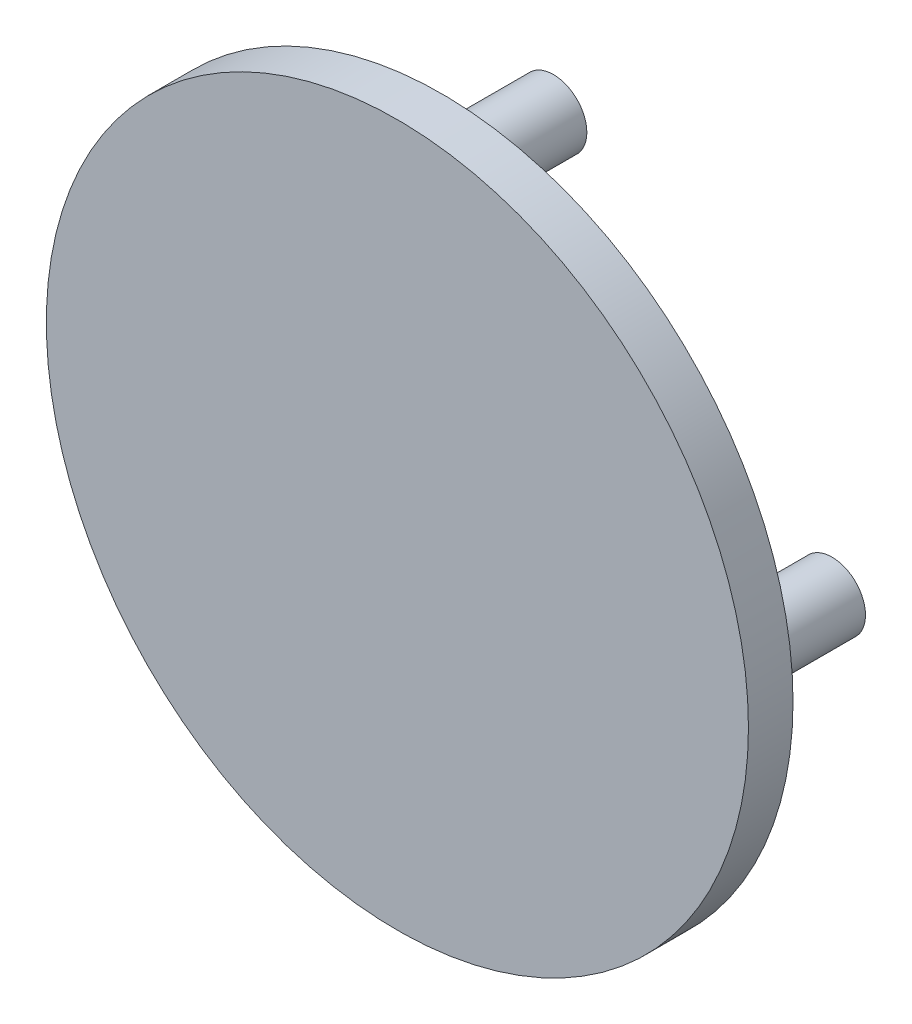
ISO-10303-21;
HEADER;
FILE_DESCRIPTION(('STEP AP214'),'2;1');
FILE_NAME('part.step','',(''),(''),'','','');
FILE_SCHEMA(('AUTOMOTIVE_DESIGN { 1 0 10303 214 1 1 1 1 }'));
ENDSEC;
DATA;
#1=APPLICATION_CONTEXT('core data for automotive mechanical design processes');
#2=APPLICATION_PROTOCOL_DEFINITION('international standard','automotive_design',2000,#1);
#3=PRODUCT_CONTEXT('',#1,'mechanical');
#4=PRODUCT('Part','Part','',(#3));
#5=PRODUCT_RELATED_PRODUCT_CATEGORY('part','',(#4));
#6=PRODUCT_DEFINITION_FORMATION('','',#4);
#7=PRODUCT_DEFINITION_CONTEXT('part definition',#1,'design');
#8=PRODUCT_DEFINITION('design','',#6,#7);
#9=PRODUCT_DEFINITION_SHAPE('','',#8);
#10=(LENGTH_UNIT() NAMED_UNIT(*) SI_UNIT(.MILLI.,.METRE.));
#11=(NAMED_UNIT(*) PLANE_ANGLE_UNIT() SI_UNIT($,.RADIAN.));
#12=(NAMED_UNIT(*) SI_UNIT($,.STERADIAN.) SOLID_ANGLE_UNIT());
#13=UNCERTAINTY_MEASURE_WITH_UNIT(LENGTH_MEASURE(1.E-05),#10,'distance_accuracy_value','');
#14=(GEOMETRIC_REPRESENTATION_CONTEXT(3) GLOBAL_UNCERTAINTY_ASSIGNED_CONTEXT((#13)) GLOBAL_UNIT_ASSIGNED_CONTEXT((#10,
#11,#12)) REPRESENTATION_CONTEXT('',''));
#15=CARTESIAN_POINT('',(0.,0.,0.));
#16=DIRECTION('',(0.,0.,1.));
#17=DIRECTION('',(1.,0.,0.));
#18=AXIS2_PLACEMENT_3D('',#15,#16,#17);
#19=CARTESIAN_POINT('',(0.,0.,8.));
#20=DIRECTION('',(0.,0.,-1.));
#21=DIRECTION('',(-1.,0.,0.));
#22=AXIS2_PLACEMENT_3D('',#19,#20,#21);
#23=CYLINDRICAL_SURFACE('',#22,25.);
#24=CARTESIAN_POINT('',(0.,0.,8.));
#25=DIRECTION('',(0.,0.,1.));
#26=DIRECTION('',(1.,0.,0.));
#27=AXIS2_PLACEMENT_3D('',#24,#25,#26);
#28=CIRCLE('',#27,25.);
#29=CARTESIAN_POINT('',(25.,0.,8.));
#30=VERTEX_POINT('',#29);
#31=EDGE_CURVE('E50',#30,#30,#28,.T.);
#32=ORIENTED_EDGE('',*,*,#31,.F.);
#33=EDGE_LOOP('',(#32));
#34=FACE_BOUND('',#33,.T.);
#35=CARTESIAN_POINT('',(0.,0.,0.));
#36=DIRECTION('',(0.,0.,1.));
#37=DIRECTION('',(1.,0.,0.));
#38=AXIS2_PLACEMENT_3D('',#35,#36,#37);
#39=CIRCLE('',#38,25.);
#40=CARTESIAN_POINT('',(25.,0.,0.));
#41=VERTEX_POINT('',#40);
#42=EDGE_CURVE('E51',#41,#41,#39,.T.);
#43=ORIENTED_EDGE('',*,*,#42,.T.);
#44=EDGE_LOOP('',(#43));
#45=FACE_BOUND('',#44,.T.);
#46=ADVANCED_FACE('F31',(#34,#45),#23,.T.);
#47=CARTESIAN_POINT('',(0.,0.,0.));
#48=DIRECTION('',(0.,0.,1.));
#49=DIRECTION('',(1.,0.,0.));
#50=AXIS2_PLACEMENT_3D('',#47,#48,#49);
#51=PLANE('',#50);
#52=ORIENTED_EDGE('',*,*,#42,.F.);
#53=EDGE_LOOP('',(#52));
#54=FACE_BOUND('',#53,.T.);
#55=ADVANCED_FACE('F90',(#54),#51,.F.);
#56=CARTESIAN_POINT('',(0.,0.,16.));
#57=DIRECTION('',(0.,0.,-1.));
#58=DIRECTION('',(-1.,0.,0.));
#59=AXIS2_PLACEMENT_3D('',#56,#57,#58);
#60=CYLINDRICAL_SURFACE('',#59,63.);
#61=CARTESIAN_POINT('',(0.,0.,16.));
#62=DIRECTION('',(0.,0.,1.));
#63=DIRECTION('',(1.,0.,0.));
#64=AXIS2_PLACEMENT_3D('',#61,#62,#63);
#65=CIRCLE('',#64,63.);
#66=CARTESIAN_POINT('',(63.,0.,16.));
#67=VERTEX_POINT('',#66);
#68=EDGE_CURVE('E54',#67,#67,#65,.T.);
#69=ORIENTED_EDGE('',*,*,#68,.F.);
#70=EDGE_LOOP('',(#69));
#71=FACE_BOUND('',#70,.T.);
#72=CARTESIAN_POINT('',(0.,0.,8.));
#73=DIRECTION('',(0.,0.,1.));
#74=DIRECTION('',(1.,0.,0.));
#75=AXIS2_PLACEMENT_3D('',#72,#73,#74);
#76=CIRCLE('',#75,63.);
#77=CARTESIAN_POINT('',(63.,0.,8.));
#78=VERTEX_POINT('',#77);
#79=EDGE_CURVE('E57',#78,#78,#76,.T.);
#80=ORIENTED_EDGE('',*,*,#79,.T.);
#81=EDGE_LOOP('',(#80));
#82=FACE_BOUND('',#81,.T.);
#83=ADVANCED_FACE('F95',(#71,#82),#60,.T.);
#84=CARTESIAN_POINT('',(0.,0.,16.));
#85=DIRECTION('',(0.,0.,1.));
#86=DIRECTION('',(1.,0.,0.));
#87=AXIS2_PLACEMENT_3D('',#84,#85,#86);
#88=PLANE('',#87);
#89=ORIENTED_EDGE('',*,*,#68,.T.);
#90=EDGE_LOOP('',(#89));
#91=FACE_BOUND('',#90,.T.);
#92=ADVANCED_FACE('F105',(#91),#88,.T.);
#93=CARTESIAN_POINT('',(0.,0.,8.));
#94=DIRECTION('',(0.,0.,1.));
#95=DIRECTION('',(1.,0.,0.));
#96=AXIS2_PLACEMENT_3D('',#93,#94,#95);
#97=PLANE('',#96);
#98=CARTESIAN_POINT('',(49.9999999999986,-1.4210854715202E-12,8.));
#99=DIRECTION('',(0.,0.,1.));
#100=DIRECTION('',(1.,0.,0.));
#101=AXIS2_PLACEMENT_3D('',#98,#99,#100);
#102=CIRCLE('',#101,6.00000000000227);
#103=CARTESIAN_POINT('',(56.0000000000009,-1.4210854715202E-12,8.));
#104=VERTEX_POINT('',#103);
#105=EDGE_CURVE('E10',#104,#104,#102,.F.);
#106=ORIENTED_EDGE('',*,*,#105,.F.);
#107=EDGE_LOOP('',(#106));
#108=FACE_BOUND('',#107,.T.);
#109=CARTESIAN_POINT('',(-2.82992447504893E-12,-50.,8.));
#110=DIRECTION('',(0.,0.,1.));
#111=DIRECTION('',(1.,0.,0.));
#112=AXIS2_PLACEMENT_3D('',#109,#110,#111);
#113=CIRCLE('',#112,6.00000000000304);
#114=CARTESIAN_POINT('',(6.00000000000021,-50.,8.));
#115=VERTEX_POINT('',#114);
#116=EDGE_CURVE('E37',#115,#115,#113,.F.);
#117=ORIENTED_EDGE('',*,*,#116,.F.);
#118=EDGE_LOOP('',(#117));
#119=FACE_BOUND('',#118,.T.);
#120=CARTESIAN_POINT('',(-50.0000000000014,1.41496223752446E-12,8.));
#121=DIRECTION('',(0.,0.,1.));
#122=DIRECTION('',(1.,0.,0.));
#123=AXIS2_PLACEMENT_3D('',#120,#121,#122);
#124=CIRCLE('',#123,6.0000000000011);
#125=CARTESIAN_POINT('',(-44.0000000000003,1.41496223752446E-12,8.));
#126=VERTEX_POINT('',#125);
#127=EDGE_CURVE('E41',#126,#126,#124,.F.);
#128=ORIENTED_EDGE('',*,*,#127,.F.);
#129=EDGE_LOOP('',(#128));
#130=FACE_BOUND('',#129,.T.);
#131=CARTESIAN_POINT('',(0.,50.,8.));
#132=DIRECTION('',(0.,0.,1.));
#133=DIRECTION('',(1.,0.,0.));
#134=AXIS2_PLACEMENT_3D('',#131,#132,#133);
#135=CIRCLE('',#134,6.);
#136=CARTESIAN_POINT('',(6.,50.,8.));
#137=VERTEX_POINT('',#136);
#138=EDGE_CURVE('E45',#137,#137,#135,.F.);
#139=ORIENTED_EDGE('',*,*,#138,.F.);
#140=EDGE_LOOP('',(#139));
#141=FACE_BOUND('',#140,.T.);
#142=ORIENTED_EDGE('',*,*,#31,.T.);
#143=EDGE_LOOP('',(#142));
#144=FACE_BOUND('',#143,.T.);
#145=ORIENTED_EDGE('',*,*,#79,.F.);
#146=EDGE_LOOP('',(#145));
#147=FACE_BOUND('',#146,.T.);
#148=ADVANCED_FACE('F101',(#108,#119,#130,#141,#144,#147),#97,.F.);
#149=CARTESIAN_POINT('',(0.,50.,-12.));
#150=DIRECTION('',(0.,0.,1.));
#151=DIRECTION('',(1.,0.,0.));
#152=AXIS2_PLACEMENT_3D('',#149,#150,#151);
#153=CYLINDRICAL_SURFACE('',#152,6.);
#154=CARTESIAN_POINT('',(0.,50.,-12.));
#155=DIRECTION('',(0.,0.,-1.));
#156=DIRECTION('',(-1.,0.,0.));
#157=AXIS2_PLACEMENT_3D('',#154,#155,#156);
#158=CIRCLE('',#157,6.);
#159=CARTESIAN_POINT('',(-6.,50.,-12.));
#160=VERTEX_POINT('',#159);
#161=EDGE_CURVE('E60',#160,#160,#158,.T.);
#162=ORIENTED_EDGE('',*,*,#161,.F.);
#163=EDGE_LOOP('',(#162));
#164=FACE_BOUND('',#163,.T.);
#165=ORIENTED_EDGE('',*,*,#138,.T.);
#166=EDGE_LOOP('',(#165));
#167=FACE_BOUND('',#166,.T.);
#168=ADVANCED_FACE('F104',(#164,#167),#153,.T.);
#169=CARTESIAN_POINT('',(0.,50.,-12.));
#170=DIRECTION('',(0.,0.,-1.));
#171=DIRECTION('',(-1.,0.,0.));
#172=AXIS2_PLACEMENT_3D('',#169,#170,#171);
#173=PLANE('',#172);
#174=ORIENTED_EDGE('',*,*,#161,.T.);
#175=EDGE_LOOP('',(#174));
#176=FACE_BOUND('',#175,.T.);
#177=ADVANCED_FACE('F122',(#176),#173,.T.);
#178=CARTESIAN_POINT('',(-50.0000000000014,1.41496223752446E-12,-12.));
#179=DIRECTION('',(0.,0.,1.));
#180=DIRECTION('',(1.,0.,0.));
#181=AXIS2_PLACEMENT_3D('',#178,#179,#180);
#182=CYLINDRICAL_SURFACE('',#181,6.0000000000011);
#183=CARTESIAN_POINT('',(-50.0000000000014,1.41496223752446E-12,-12.));
#184=DIRECTION('',(0.,0.,-1.));
#185=DIRECTION('',(-1.,0.,0.));
#186=AXIS2_PLACEMENT_3D('',#183,#184,#185);
#187=CIRCLE('',#186,6.0000000000011);
#188=CARTESIAN_POINT('',(-56.0000000000025,1.41496223752446E-12,-12.));
#189=VERTEX_POINT('',#188);
#190=EDGE_CURVE('E65',#189,#189,#187,.T.);
#191=ORIENTED_EDGE('',*,*,#190,.F.);
#192=EDGE_LOOP('',(#191));
#193=FACE_BOUND('',#192,.T.);
#194=ORIENTED_EDGE('',*,*,#127,.T.);
#195=EDGE_LOOP('',(#194));
#196=FACE_BOUND('',#195,.T.);
#197=ADVANCED_FACE('F126',(#193,#196),#182,.T.);
#198=CARTESIAN_POINT('',(-50.0000000000014,1.41496223752446E-12,-12.));
#199=DIRECTION('',(0.,0.,-1.));
#200=DIRECTION('',(-1.,0.,0.));
#201=AXIS2_PLACEMENT_3D('',#198,#199,#200);
#202=PLANE('',#201);
#203=ORIENTED_EDGE('',*,*,#190,.T.);
#204=EDGE_LOOP('',(#203));
#205=FACE_BOUND('',#204,.T.);
#206=ADVANCED_FACE('F130',(#205),#202,.T.);
#207=CARTESIAN_POINT('',(-2.82992447504893E-12,-50.,-12.));
#208=DIRECTION('',(0.,0.,1.));
#209=DIRECTION('',(1.,0.,0.));
#210=AXIS2_PLACEMENT_3D('',#207,#208,#209);
#211=CYLINDRICAL_SURFACE('',#210,6.00000000000304);
#212=CARTESIAN_POINT('',(-2.82992447504893E-12,-50.,-12.));
#213=DIRECTION('',(0.,0.,-1.));
#214=DIRECTION('',(-1.,0.,0.));
#215=AXIS2_PLACEMENT_3D('',#212,#213,#214);
#216=CIRCLE('',#215,6.00000000000304);
#217=CARTESIAN_POINT('',(-6.00000000000587,-50.,-12.));
#218=VERTEX_POINT('',#217);
#219=EDGE_CURVE('E68',#218,#218,#216,.T.);
#220=ORIENTED_EDGE('',*,*,#219,.F.);
#221=EDGE_LOOP('',(#220));
#222=FACE_BOUND('',#221,.T.);
#223=ORIENTED_EDGE('',*,*,#116,.T.);
#224=EDGE_LOOP('',(#223));
#225=FACE_BOUND('',#224,.T.);
#226=ADVANCED_FACE('F86',(#222,#225),#211,.T.);
#227=CARTESIAN_POINT('',(-2.82992447504893E-12,-50.,-12.));
#228=DIRECTION('',(0.,0.,-1.));
#229=DIRECTION('',(-1.,0.,0.));
#230=AXIS2_PLACEMENT_3D('',#227,#228,#229);
#231=PLANE('',#230);
#232=ORIENTED_EDGE('',*,*,#219,.T.);
#233=EDGE_LOOP('',(#232));
#234=FACE_BOUND('',#233,.T.);
#235=ADVANCED_FACE('F79',(#234),#231,.T.);
#236=CARTESIAN_POINT('',(49.9999999999986,-1.4210854715202E-12,-12.));
#237=DIRECTION('',(0.,0.,1.));
#238=DIRECTION('',(1.,0.,0.));
#239=AXIS2_PLACEMENT_3D('',#236,#237,#238);
#240=CYLINDRICAL_SURFACE('',#239,6.00000000000227);
#241=CARTESIAN_POINT('',(49.9999999999986,-1.4210854715202E-12,-12.));
#242=DIRECTION('',(0.,0.,-1.));
#243=DIRECTION('',(-1.,0.,0.));
#244=AXIS2_PLACEMENT_3D('',#241,#242,#243);
#245=CIRCLE('',#244,6.00000000000227);
#246=CARTESIAN_POINT('',(43.9999999999963,-1.4210854715202E-12,-12.));
#247=VERTEX_POINT('',#246);
#248=EDGE_CURVE('E71',#247,#247,#245,.T.);
#249=ORIENTED_EDGE('',*,*,#248,.F.);
#250=EDGE_LOOP('',(#249));
#251=FACE_BOUND('',#250,.T.);
#252=ORIENTED_EDGE('',*,*,#105,.T.);
#253=EDGE_LOOP('',(#252));
#254=FACE_BOUND('',#253,.T.);
#255=ADVANCED_FACE('F77',(#251,#254),#240,.T.);
#256=CARTESIAN_POINT('',(49.9999999999986,-1.4210854715202E-12,-12.));
#257=DIRECTION('',(0.,0.,-1.));
#258=DIRECTION('',(-1.,0.,0.));
#259=AXIS2_PLACEMENT_3D('',#256,#257,#258);
#260=PLANE('',#259);
#261=ORIENTED_EDGE('',*,*,#248,.T.);
#262=EDGE_LOOP('',(#261));
#263=FACE_BOUND('',#262,.T.);
#264=ADVANCED_FACE('F75',(#263),#260,.T.);
#265=CLOSED_SHELL('',(#46,#55,#83,#92,#148,#168,#177,#197,#206,#226,#235,#255,#264));
#266=MANIFOLD_SOLID_BREP('B2',#265);
#267=ADVANCED_BREP_SHAPE_REPRESENTATION('',(#18,#266),#14);
#268=SHAPE_DEFINITION_REPRESENTATION(#9,#267);
ENDSEC;
END-ISO-10303-21;
